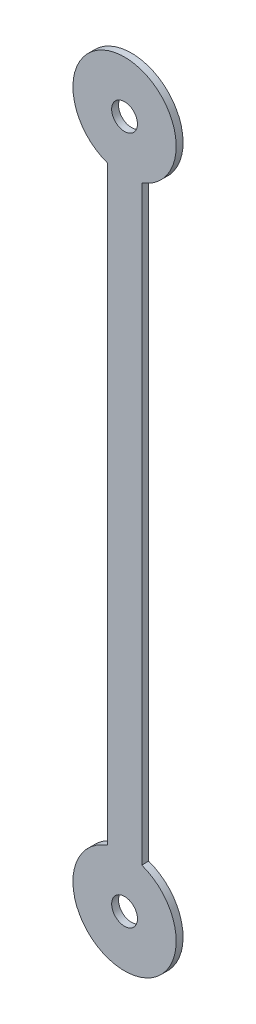
ISO-10303-21;
HEADER;
FILE_DESCRIPTION(('STEP AP214'),'2;1');
FILE_NAME('part.step','',(''),(''),'','','');
FILE_SCHEMA(('AUTOMOTIVE_DESIGN { 1 0 10303 214 1 1 1 1 }'));
ENDSEC;
DATA;
#1=APPLICATION_CONTEXT('core data for automotive mechanical design processes');
#2=APPLICATION_PROTOCOL_DEFINITION('international standard','automotive_design',2000,#1);
#3=PRODUCT_CONTEXT('',#1,'mechanical');
#4=PRODUCT('Part','Part','',(#3));
#5=PRODUCT_RELATED_PRODUCT_CATEGORY('part','',(#4));
#6=PRODUCT_DEFINITION_FORMATION('','',#4);
#7=PRODUCT_DEFINITION_CONTEXT('part definition',#1,'design');
#8=PRODUCT_DEFINITION('design','',#6,#7);
#9=PRODUCT_DEFINITION_SHAPE('','',#8);
#10=(LENGTH_UNIT() NAMED_UNIT(*) SI_UNIT(.MILLI.,.METRE.));
#11=(NAMED_UNIT(*) PLANE_ANGLE_UNIT() SI_UNIT($,.RADIAN.));
#12=(NAMED_UNIT(*) SI_UNIT($,.STERADIAN.) SOLID_ANGLE_UNIT());
#13=UNCERTAINTY_MEASURE_WITH_UNIT(LENGTH_MEASURE(1.E-05),#10,'distance_accuracy_value','');
#14=(GEOMETRIC_REPRESENTATION_CONTEXT(3) GLOBAL_UNCERTAINTY_ASSIGNED_CONTEXT((#13)) GLOBAL_UNIT_ASSIGNED_CONTEXT((#10,
#11,#12)) REPRESENTATION_CONTEXT('',''));
#15=CARTESIAN_POINT('',(0.,0.,0.));
#16=DIRECTION('',(0.,0.,1.));
#17=DIRECTION('',(1.,0.,0.));
#18=AXIS2_PLACEMENT_3D('',#15,#16,#17);
#19=CARTESIAN_POINT('',(0.,-10.,0.1));
#20=DIRECTION('',(0.,0.,1.));
#21=DIRECTION('',(1.,0.,0.));
#22=AXIS2_PLACEMENT_3D('',#19,#20,#21);
#23=PLANE('',#22);
#24=CARTESIAN_POINT('',(0.,10.,0.1));
#25=DIRECTION('',(0.,0.,1.));
#26=DIRECTION('',(1.,0.,0.));
#27=AXIS2_PLACEMENT_3D('',#24,#25,#26);
#28=CIRCLE('',#27,0.375000000000001);
#29=CARTESIAN_POINT('',(0.375,10.,0.1));
#30=VERTEX_POINT('',#29);
#31=EDGE_CURVE('E101',#30,#30,#28,.T.);
#32=ORIENTED_EDGE('',*,*,#31,.F.);
#33=EDGE_LOOP('',(#32));
#34=FACE_BOUND('',#33,.T.);
#35=CARTESIAN_POINT('',(0.,-10.,0.1));
#36=DIRECTION('',(0.,0.,1.));
#37=DIRECTION('',(1.,0.,0.));
#38=AXIS2_PLACEMENT_3D('',#35,#36,#37);
#39=CIRCLE('',#38,1.5);
#40=CARTESIAN_POINT('',(-0.500000000000001,-8.5857864376269,0.1));
#41=VERTEX_POINT('',#40);
#42=CARTESIAN_POINT('',(0.499999999999999,-8.5857864376269,0.1));
#43=VERTEX_POINT('',#42);
#44=EDGE_CURVE('E86',#41,#43,#39,.T.);
#45=ORIENTED_EDGE('',*,*,#44,.T.);
#46=DIRECTION('',(0.,1.,0.));
#47=VECTOR('',#46,1.);
#48=CARTESIAN_POINT('',(0.499999999999999,8.5857864376269,0.1));
#49=LINE('',#48,#47);
#50=CARTESIAN_POINT('',(0.499999999999999,8.5857864376269,0.1));
#51=VERTEX_POINT('',#50);
#52=EDGE_CURVE('E81',#43,#51,#49,.T.);
#53=ORIENTED_EDGE('',*,*,#52,.T.);
#54=CARTESIAN_POINT('',(0.,10.,0.1));
#55=DIRECTION('',(0.,0.,1.));
#56=DIRECTION('',(1.,0.,0.));
#57=AXIS2_PLACEMENT_3D('',#54,#55,#56);
#58=CIRCLE('',#57,1.5);
#59=CARTESIAN_POINT('',(-0.500000000000001,8.5857864376269,0.1));
#60=VERTEX_POINT('',#59);
#61=EDGE_CURVE('E84',#51,#60,#58,.T.);
#62=ORIENTED_EDGE('',*,*,#61,.T.);
#63=DIRECTION('',(0.,-1.,0.));
#64=VECTOR('',#63,1.);
#65=CARTESIAN_POINT('',(-0.500000000000001,8.5857864376269,0.1));
#66=LINE('',#65,#64);
#67=EDGE_CURVE('E51',#60,#41,#66,.T.);
#68=ORIENTED_EDGE('',*,*,#67,.T.);
#69=EDGE_LOOP('',(#45,#53,#62,#68));
#70=FACE_BOUND('',#69,.T.);
#71=CARTESIAN_POINT('',(0.,-10.,0.1));
#72=DIRECTION('',(0.,0.,1.));
#73=DIRECTION('',(1.,0.,0.));
#74=AXIS2_PLACEMENT_3D('',#71,#72,#73);
#75=CIRCLE('',#74,0.375);
#76=CARTESIAN_POINT('',(0.375000000000006,-10.,0.1));
#77=VERTEX_POINT('',#76);
#78=EDGE_CURVE('E116',#77,#77,#75,.T.);
#79=ORIENTED_EDGE('',*,*,#78,.F.);
#80=EDGE_LOOP('',(#79));
#81=FACE_BOUND('',#80,.T.);
#82=ADVANCED_FACE('F34',(#34,#70,#81),#23,.T.);
#83=CARTESIAN_POINT('',(0.,-10.,-0.1));
#84=DIRECTION('',(0.,0.,1.));
#85=DIRECTION('',(1.,0.,0.));
#86=AXIS2_PLACEMENT_3D('',#83,#84,#85);
#87=PLANE('',#86);
#88=CARTESIAN_POINT('',(0.,-10.,-0.1));
#89=DIRECTION('',(0.,0.,1.));
#90=DIRECTION('',(1.,0.,0.));
#91=AXIS2_PLACEMENT_3D('',#88,#89,#90);
#92=CIRCLE('',#91,1.5);
#93=CARTESIAN_POINT('',(-0.500000000000001,-8.5857864376269,-0.1));
#94=VERTEX_POINT('',#93);
#95=CARTESIAN_POINT('',(0.499999999999999,-8.5857864376269,-0.1));
#96=VERTEX_POINT('',#95);
#97=EDGE_CURVE('E98',#94,#96,#92,.T.);
#98=ORIENTED_EDGE('',*,*,#97,.F.);
#99=DIRECTION('',(0.,-1.,0.));
#100=VECTOR('',#99,1.);
#101=CARTESIAN_POINT('',(-0.500000000000001,8.5857864376269,-0.1));
#102=LINE('',#101,#100);
#103=CARTESIAN_POINT('',(-0.500000000000001,8.5857864376269,-0.1));
#104=VERTEX_POINT('',#103);
#105=EDGE_CURVE('E74',#104,#94,#102,.T.);
#106=ORIENTED_EDGE('',*,*,#105,.F.);
#107=CARTESIAN_POINT('',(0.,10.,-0.1));
#108=DIRECTION('',(0.,0.,1.));
#109=DIRECTION('',(1.,0.,0.));
#110=AXIS2_PLACEMENT_3D('',#107,#108,#109);
#111=CIRCLE('',#110,1.5);
#112=CARTESIAN_POINT('',(0.499999999999999,8.5857864376269,-0.1));
#113=VERTEX_POINT('',#112);
#114=EDGE_CURVE('E68',#113,#104,#111,.T.);
#115=ORIENTED_EDGE('',*,*,#114,.F.);
#116=DIRECTION('',(0.,1.,0.));
#117=VECTOR('',#116,1.);
#118=CARTESIAN_POINT('',(0.499999999999999,8.5857864376269,-0.1));
#119=LINE('',#118,#117);
#120=EDGE_CURVE('E90',#96,#113,#119,.T.);
#121=ORIENTED_EDGE('',*,*,#120,.F.);
#122=EDGE_LOOP('',(#98,#106,#115,#121));
#123=FACE_BOUND('',#122,.T.);
#124=CARTESIAN_POINT('',(0.,10.,-0.1));
#125=DIRECTION('',(0.,0.,1.));
#126=DIRECTION('',(1.,0.,0.));
#127=AXIS2_PLACEMENT_3D('',#124,#125,#126);
#128=CIRCLE('',#127,0.375000000000001);
#129=CARTESIAN_POINT('',(0.375,10.,-0.1));
#130=VERTEX_POINT('',#129);
#131=EDGE_CURVE('E113',#130,#130,#128,.T.);
#132=ORIENTED_EDGE('',*,*,#131,.T.);
#133=EDGE_LOOP('',(#132));
#134=FACE_BOUND('',#133,.T.);
#135=CARTESIAN_POINT('',(0.,-10.,-0.1));
#136=DIRECTION('',(0.,0.,1.));
#137=DIRECTION('',(1.,0.,0.));
#138=AXIS2_PLACEMENT_3D('',#135,#136,#137);
#139=CIRCLE('',#138,0.375);
#140=CARTESIAN_POINT('',(0.375000000000006,-10.,-0.1));
#141=VERTEX_POINT('',#140);
#142=EDGE_CURVE('E119',#141,#141,#139,.T.);
#143=ORIENTED_EDGE('',*,*,#142,.T.);
#144=EDGE_LOOP('',(#143));
#145=FACE_BOUND('',#144,.T.);
#146=ADVANCED_FACE('F109',(#123,#134,#145),#87,.F.);
#147=CARTESIAN_POINT('',(0.,-10.,0.1));
#148=DIRECTION('',(0.,0.,-1.));
#149=DIRECTION('',(-1.,0.,0.));
#150=AXIS2_PLACEMENT_3D('',#147,#148,#149);
#151=CYLINDRICAL_SURFACE('',#150,1.5);
#152=ORIENTED_EDGE('',*,*,#97,.T.);
#153=DIRECTION('',(0.,0.,-1.));
#154=VECTOR('',#153,1.);
#155=CARTESIAN_POINT('',(0.499999999999999,-8.5857864376269,0.1));
#156=LINE('',#155,#154);
#157=EDGE_CURVE('E11',#43,#96,#156,.T.);
#158=ORIENTED_EDGE('',*,*,#157,.F.);
#159=ORIENTED_EDGE('',*,*,#44,.F.);
#160=DIRECTION('',(0.,0.,-1.));
#161=VECTOR('',#160,1.);
#162=CARTESIAN_POINT('',(-0.500000000000001,-8.5857864376269,0.1));
#163=LINE('',#162,#161);
#164=EDGE_CURVE('E94',#41,#94,#163,.T.);
#165=ORIENTED_EDGE('',*,*,#164,.T.);
#166=EDGE_LOOP('',(#152,#158,#159,#165));
#167=FACE_BOUND('',#166,.T.);
#168=ADVANCED_FACE('F36',(#167),#151,.T.);
#169=CARTESIAN_POINT('',(0.499999999999999,8.5857864376269,0.1));
#170=DIRECTION('',(-1.,0.,0.));
#171=DIRECTION('',(0.,0.,1.));
#172=AXIS2_PLACEMENT_3D('',#169,#170,#171);
#173=PLANE('',#172);
#174=ORIENTED_EDGE('',*,*,#120,.T.);
#175=DIRECTION('',(0.,0.,-1.));
#176=VECTOR('',#175,1.);
#177=CARTESIAN_POINT('',(0.499999999999999,8.5857864376269,0.1));
#178=LINE('',#177,#176);
#179=EDGE_CURVE('E43',#51,#113,#178,.T.);
#180=ORIENTED_EDGE('',*,*,#179,.F.);
#181=ORIENTED_EDGE('',*,*,#52,.F.);
#182=ORIENTED_EDGE('',*,*,#157,.T.);
#183=EDGE_LOOP('',(#174,#180,#181,#182));
#184=FACE_BOUND('',#183,.T.);
#185=ADVANCED_FACE('F89',(#184),#173,.F.);
#186=CARTESIAN_POINT('',(0.,10.,0.1));
#187=DIRECTION('',(0.,0.,-1.));
#188=DIRECTION('',(-1.,0.,0.));
#189=AXIS2_PLACEMENT_3D('',#186,#187,#188);
#190=CYLINDRICAL_SURFACE('',#189,1.5);
#191=ORIENTED_EDGE('',*,*,#114,.T.);
#192=DIRECTION('',(0.,0.,-1.));
#193=VECTOR('',#192,1.);
#194=CARTESIAN_POINT('',(-0.500000000000001,8.5857864376269,0.1));
#195=LINE('',#194,#193);
#196=EDGE_CURVE('E91',#60,#104,#195,.T.);
#197=ORIENTED_EDGE('',*,*,#196,.F.);
#198=ORIENTED_EDGE('',*,*,#61,.F.);
#199=ORIENTED_EDGE('',*,*,#179,.T.);
#200=EDGE_LOOP('',(#191,#197,#198,#199));
#201=FACE_BOUND('',#200,.T.);
#202=ADVANCED_FACE('F92',(#201),#190,.T.);
#203=CARTESIAN_POINT('',(-0.500000000000001,8.5857864376269,0.1));
#204=DIRECTION('',(1.,0.,0.));
#205=DIRECTION('',(0.,0.,-1.));
#206=AXIS2_PLACEMENT_3D('',#203,#204,#205);
#207=PLANE('',#206);
#208=ORIENTED_EDGE('',*,*,#105,.T.);
#209=ORIENTED_EDGE('',*,*,#164,.F.);
#210=ORIENTED_EDGE('',*,*,#67,.F.);
#211=ORIENTED_EDGE('',*,*,#196,.T.);
#212=EDGE_LOOP('',(#208,#209,#210,#211));
#213=FACE_BOUND('',#212,.T.);
#214=ADVANCED_FACE('F106',(#213),#207,.F.);
#215=CARTESIAN_POINT('',(0.,10.,0.1));
#216=DIRECTION('',(0.,0.,-1.));
#217=DIRECTION('',(-1.,0.,0.));
#218=AXIS2_PLACEMENT_3D('',#215,#216,#217);
#219=CYLINDRICAL_SURFACE('',#218,0.375000000000001);
#220=ORIENTED_EDGE('',*,*,#31,.T.);
#221=EDGE_LOOP('',(#220));
#222=FACE_BOUND('',#221,.T.);
#223=ORIENTED_EDGE('',*,*,#131,.F.);
#224=EDGE_LOOP('',(#223));
#225=FACE_BOUND('',#224,.T.);
#226=ADVANCED_FACE('F136',(#222,#225),#219,.F.);
#227=CARTESIAN_POINT('',(0.,-10.,0.1));
#228=DIRECTION('',(0.,0.,-1.));
#229=DIRECTION('',(-1.,0.,0.));
#230=AXIS2_PLACEMENT_3D('',#227,#228,#229);
#231=CYLINDRICAL_SURFACE('',#230,0.375);
#232=ORIENTED_EDGE('',*,*,#78,.T.);
#233=EDGE_LOOP('',(#232));
#234=FACE_BOUND('',#233,.T.);
#235=ORIENTED_EDGE('',*,*,#142,.F.);
#236=EDGE_LOOP('',(#235));
#237=FACE_BOUND('',#236,.T.);
#238=ADVANCED_FACE('F125',(#234,#237),#231,.F.);
#239=CLOSED_SHELL('',(#82,#146,#168,#185,#202,#214,#226,#238));
#240=MANIFOLD_SOLID_BREP('B2',#239);
#241=ADVANCED_BREP_SHAPE_REPRESENTATION('',(#18,#240),#14);
#242=SHAPE_DEFINITION_REPRESENTATION(#9,#241);
ENDSEC;
END-ISO-10303-21;
